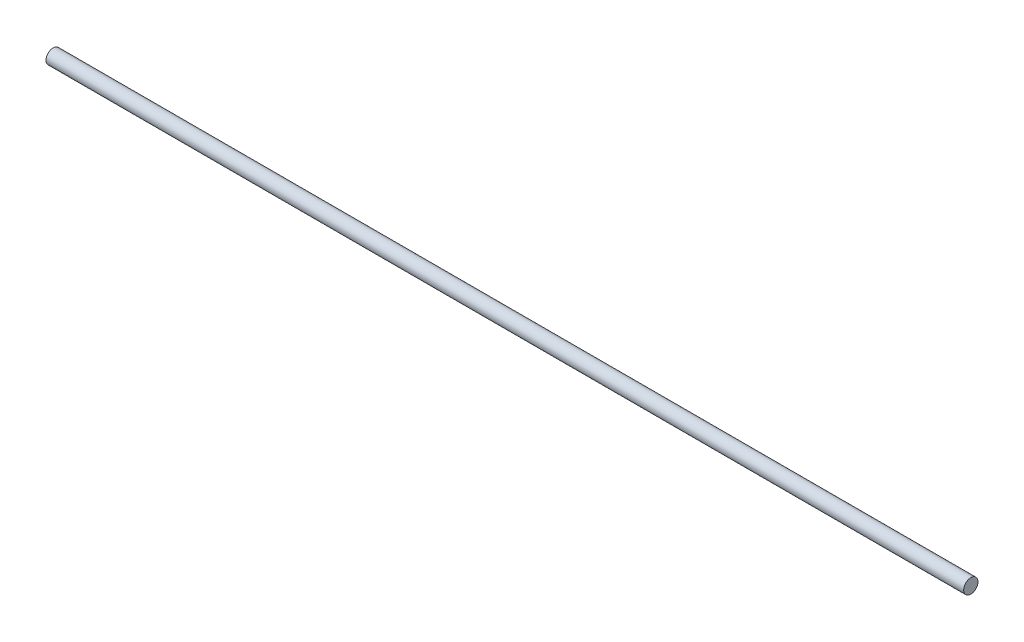
ISO-10303-21;
HEADER;
FILE_DESCRIPTION(('STEP AP214'),'2;1');
FILE_NAME('part.step','',(''),(''),'','','');
FILE_SCHEMA(('AUTOMOTIVE_DESIGN { 1 0 10303 214 1 1 1 1 }'));
ENDSEC;
DATA;
#1=APPLICATION_CONTEXT('core data for automotive mechanical design processes');
#2=APPLICATION_PROTOCOL_DEFINITION('international standard','automotive_design',2000,#1);
#3=PRODUCT_CONTEXT('',#1,'mechanical');
#4=PRODUCT('Part','Part','',(#3));
#5=PRODUCT_RELATED_PRODUCT_CATEGORY('part','',(#4));
#6=PRODUCT_DEFINITION_FORMATION('','',#4);
#7=PRODUCT_DEFINITION_CONTEXT('part definition',#1,'design');
#8=PRODUCT_DEFINITION('design','',#6,#7);
#9=PRODUCT_DEFINITION_SHAPE('','',#8);
#10=(LENGTH_UNIT() NAMED_UNIT(*) SI_UNIT(.MILLI.,.METRE.));
#11=(NAMED_UNIT(*) PLANE_ANGLE_UNIT() SI_UNIT($,.RADIAN.));
#12=(NAMED_UNIT(*) SI_UNIT($,.STERADIAN.) SOLID_ANGLE_UNIT());
#13=UNCERTAINTY_MEASURE_WITH_UNIT(LENGTH_MEASURE(1.E-05),#10,'distance_accuracy_value','');
#14=(GEOMETRIC_REPRESENTATION_CONTEXT(3) GLOBAL_UNCERTAINTY_ASSIGNED_CONTEXT((#13)) GLOBAL_UNIT_ASSIGNED_CONTEXT((#10,
#11,#12)) REPRESENTATION_CONTEXT('',''));
#15=CARTESIAN_POINT('',(0.,0.,0.));
#16=DIRECTION('',(0.,0.,1.));
#17=DIRECTION('',(1.,0.,0.));
#18=AXIS2_PLACEMENT_3D('',#15,#16,#17);
#19=CARTESIAN_POINT('',(203.2,0.,0.));
#20=DIRECTION('',(1.,0.,0.));
#21=DIRECTION('',(0.,0.,-1.));
#22=AXIS2_PLACEMENT_3D('',#19,#20,#21);
#23=PLANE('',#22);
#24=CARTESIAN_POINT('',(203.2,0.,0.));
#25=DIRECTION('',(1.,0.,0.));
#26=DIRECTION('',(0.,0.,-1.));
#27=AXIS2_PLACEMENT_3D('',#24,#25,#26);
#28=CIRCLE('',#27,3.175);
#29=CARTESIAN_POINT('',(203.2,0.,-3.175));
#30=VERTEX_POINT('',#29);
#31=EDGE_CURVE('E17',#30,#30,#28,.F.);
#32=ORIENTED_EDGE('',*,*,#31,.F.);
#33=EDGE_LOOP('',(#32));
#34=FACE_BOUND('',#33,.T.);
#35=ADVANCED_FACE('F14',(#34),#23,.T.);
#36=CARTESIAN_POINT('',(-203.2,0.,0.));
#37=DIRECTION('',(1.,0.,0.));
#38=DIRECTION('',(0.,0.,-1.));
#39=AXIS2_PLACEMENT_3D('',#36,#37,#38);
#40=PLANE('',#39);
#41=CARTESIAN_POINT('',(-203.2,0.,0.));
#42=DIRECTION('',(1.,0.,0.));
#43=DIRECTION('',(0.,0.,-1.));
#44=AXIS2_PLACEMENT_3D('',#41,#42,#43);
#45=CIRCLE('',#44,3.175);
#46=CARTESIAN_POINT('',(-203.2,0.,-3.175));
#47=VERTEX_POINT('',#46);
#48=EDGE_CURVE('E10',#47,#47,#45,.T.);
#49=ORIENTED_EDGE('',*,*,#48,.F.);
#50=EDGE_LOOP('',(#49));
#51=FACE_BOUND('',#50,.T.);
#52=ADVANCED_FACE('F29',(#51),#40,.F.);
#53=CARTESIAN_POINT('',(-203.2,0.,0.));
#54=DIRECTION('',(1.,0.,0.));
#55=DIRECTION('',(0.,0.,-1.));
#56=AXIS2_PLACEMENT_3D('',#53,#54,#55);
#57=CYLINDRICAL_SURFACE('',#56,3.175);
#58=ORIENTED_EDGE('',*,*,#31,.T.);
#59=EDGE_LOOP('',(#58));
#60=FACE_BOUND('',#59,.T.);
#61=ORIENTED_EDGE('',*,*,#48,.T.);
#62=EDGE_LOOP('',(#61));
#63=FACE_BOUND('',#62,.T.);
#64=ADVANCED_FACE('F26',(#60,#63),#57,.T.);
#65=CLOSED_SHELL('',(#35,#52,#64));
#66=MANIFOLD_SOLID_BREP('B1',#65);
#67=ADVANCED_BREP_SHAPE_REPRESENTATION('',(#18,#66),#14);
#68=SHAPE_DEFINITION_REPRESENTATION(#9,#67);
ENDSEC;
END-ISO-10303-21;
